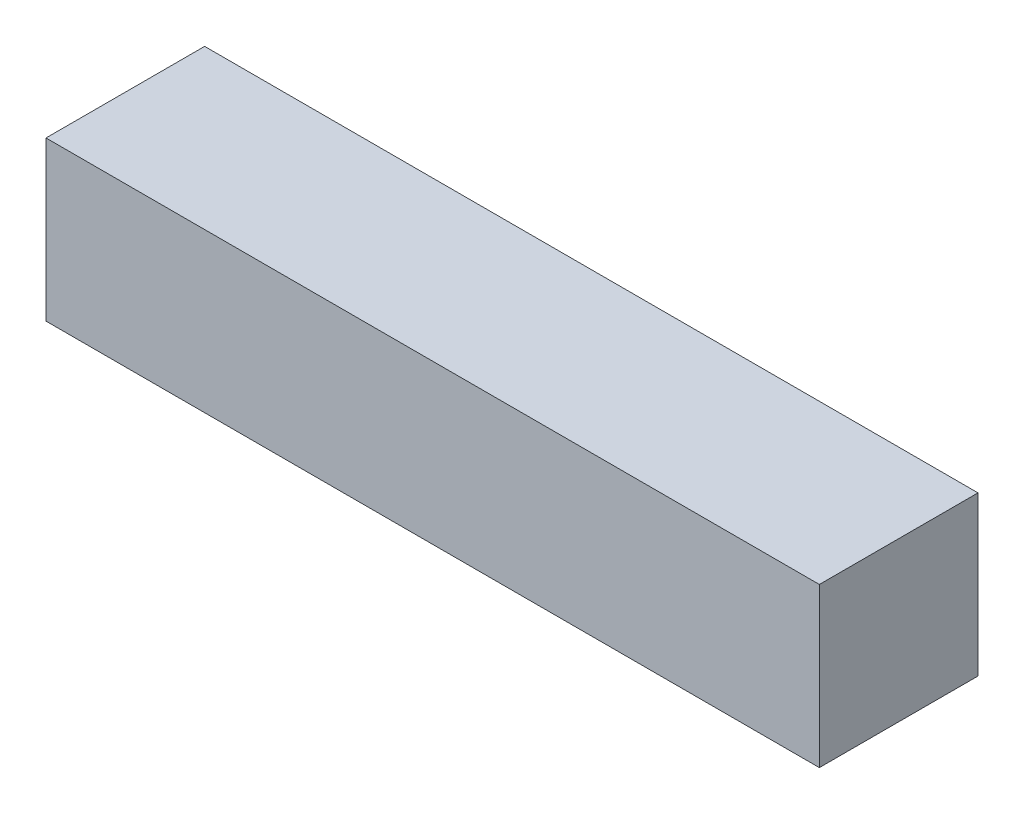
ISO-10303-21;
HEADER;
FILE_DESCRIPTION(('STEP AP214'),'2;1');
FILE_NAME('part.step','',(''),(''),'','','');
FILE_SCHEMA(('AUTOMOTIVE_DESIGN { 1 0 10303 214 1 1 1 1 }'));
ENDSEC;
DATA;
#1=APPLICATION_CONTEXT('core data for automotive mechanical design processes');
#2=APPLICATION_PROTOCOL_DEFINITION('international standard','automotive_design',2000,#1);
#3=PRODUCT_CONTEXT('',#1,'mechanical');
#4=PRODUCT('Part','Part','',(#3));
#5=PRODUCT_RELATED_PRODUCT_CATEGORY('part','',(#4));
#6=PRODUCT_DEFINITION_FORMATION('','',#4);
#7=PRODUCT_DEFINITION_CONTEXT('part definition',#1,'design');
#8=PRODUCT_DEFINITION('design','',#6,#7);
#9=PRODUCT_DEFINITION_SHAPE('','',#8);
#10=(LENGTH_UNIT() NAMED_UNIT(*) SI_UNIT(.MILLI.,.METRE.));
#11=(NAMED_UNIT(*) PLANE_ANGLE_UNIT() SI_UNIT($,.RADIAN.));
#12=(NAMED_UNIT(*) SI_UNIT($,.STERADIAN.) SOLID_ANGLE_UNIT());
#13=UNCERTAINTY_MEASURE_WITH_UNIT(LENGTH_MEASURE(1.E-05),#10,'distance_accuracy_value','');
#14=(GEOMETRIC_REPRESENTATION_CONTEXT(3) GLOBAL_UNCERTAINTY_ASSIGNED_CONTEXT((#13)) GLOBAL_UNIT_ASSIGNED_CONTEXT((#10,
#11,#12)) REPRESENTATION_CONTEXT('',''));
#15=CARTESIAN_POINT('',(0.,0.,0.));
#16=DIRECTION('',(0.,0.,1.));
#17=DIRECTION('',(1.,0.,0.));
#18=AXIS2_PLACEMENT_3D('',#15,#16,#17);
#19=CARTESIAN_POINT('',(-585.,0.,120.));
#20=DIRECTION('',(1.,0.,0.));
#21=DIRECTION('',(0.,0.,-1.));
#22=AXIS2_PLACEMENT_3D('',#19,#20,#21);
#23=PLANE('',#22);
#24=DIRECTION('',(0.,-1.,0.));
#25=VECTOR('',#24,1.);
#26=CARTESIAN_POINT('',(-585.,0.,-120.));
#27=LINE('',#26,#25);
#28=CARTESIAN_POINT('',(-585.,240.,-120.));
#29=VERTEX_POINT('',#28);
#30=CARTESIAN_POINT('',(-585.,0.,-120.));
#31=VERTEX_POINT('',#30);
#32=EDGE_CURVE('E99',#29,#31,#27,.T.);
#33=ORIENTED_EDGE('',*,*,#32,.T.);
#34=DIRECTION('',(0.,0.,-1.));
#35=VECTOR('',#34,1.);
#36=CARTESIAN_POINT('',(-585.,0.,120.));
#37=LINE('',#36,#35);
#38=CARTESIAN_POINT('',(-585.,0.,120.));
#39=VERTEX_POINT('',#38);
#40=EDGE_CURVE('E11',#39,#31,#37,.T.);
#41=ORIENTED_EDGE('',*,*,#40,.F.);
#42=DIRECTION('',(0.,-1.,0.));
#43=VECTOR('',#42,1.);
#44=CARTESIAN_POINT('',(-585.,0.,120.));
#45=LINE('',#44,#43);
#46=CARTESIAN_POINT('',(-585.,240.,120.));
#47=VERTEX_POINT('',#46);
#48=EDGE_CURVE('E87',#47,#39,#45,.T.);
#49=ORIENTED_EDGE('',*,*,#48,.F.);
#50=DIRECTION('',(0.,0.,-1.));
#51=VECTOR('',#50,1.);
#52=CARTESIAN_POINT('',(-585.,240.,120.));
#53=LINE('',#52,#51);
#54=EDGE_CURVE('E95',#47,#29,#53,.T.);
#55=ORIENTED_EDGE('',*,*,#54,.T.);
#56=EDGE_LOOP('',(#33,#41,#49,#55));
#57=FACE_BOUND('',#56,.T.);
#58=ADVANCED_FACE('F36',(#57),#23,.F.);
#59=CARTESIAN_POINT('',(-585.,0.,120.));
#60=DIRECTION('',(0.,1.,0.));
#61=DIRECTION('',(0.,0.,1.));
#62=AXIS2_PLACEMENT_3D('',#59,#60,#61);
#63=PLANE('',#62);
#64=DIRECTION('',(1.,0.,0.));
#65=VECTOR('',#64,1.);
#66=CARTESIAN_POINT('',(-585.,0.,-120.));
#67=LINE('',#66,#65);
#68=CARTESIAN_POINT('',(585.,0.,-120.));
#69=VERTEX_POINT('',#68);
#70=EDGE_CURVE('E91',#31,#69,#67,.T.);
#71=ORIENTED_EDGE('',*,*,#70,.T.);
#72=DIRECTION('',(0.,0.,-1.));
#73=VECTOR('',#72,1.);
#74=CARTESIAN_POINT('',(585.,0.,120.));
#75=LINE('',#74,#73);
#76=CARTESIAN_POINT('',(585.,0.,120.));
#77=VERTEX_POINT('',#76);
#78=EDGE_CURVE('E44',#77,#69,#75,.T.);
#79=ORIENTED_EDGE('',*,*,#78,.F.);
#80=DIRECTION('',(1.,0.,0.));
#81=VECTOR('',#80,1.);
#82=CARTESIAN_POINT('',(-585.,0.,120.));
#83=LINE('',#82,#81);
#84=EDGE_CURVE('E82',#39,#77,#83,.T.);
#85=ORIENTED_EDGE('',*,*,#84,.F.);
#86=ORIENTED_EDGE('',*,*,#40,.T.);
#87=EDGE_LOOP('',(#71,#79,#85,#86));
#88=FACE_BOUND('',#87,.T.);
#89=ADVANCED_FACE('F90',(#88),#63,.F.);
#90=CARTESIAN_POINT('',(585.,0.,120.));
#91=DIRECTION('',(-1.,0.,0.));
#92=DIRECTION('',(0.,0.,1.));
#93=AXIS2_PLACEMENT_3D('',#90,#91,#92);
#94=PLANE('',#93);
#95=DIRECTION('',(0.,1.,0.));
#96=VECTOR('',#95,1.);
#97=CARTESIAN_POINT('',(585.,0.,-120.));
#98=LINE('',#97,#96);
#99=CARTESIAN_POINT('',(585.,240.,-120.));
#100=VERTEX_POINT('',#99);
#101=EDGE_CURVE('E69',#69,#100,#98,.T.);
#102=ORIENTED_EDGE('',*,*,#101,.T.);
#103=DIRECTION('',(0.,0.,-1.));
#104=VECTOR('',#103,1.);
#105=CARTESIAN_POINT('',(585.,240.,120.));
#106=LINE('',#105,#104);
#107=CARTESIAN_POINT('',(585.,240.,120.));
#108=VERTEX_POINT('',#107);
#109=EDGE_CURVE('E92',#108,#100,#106,.T.);
#110=ORIENTED_EDGE('',*,*,#109,.F.);
#111=DIRECTION('',(0.,1.,0.));
#112=VECTOR('',#111,1.);
#113=CARTESIAN_POINT('',(585.,0.,120.));
#114=LINE('',#113,#112);
#115=EDGE_CURVE('E85',#77,#108,#114,.T.);
#116=ORIENTED_EDGE('',*,*,#115,.F.);
#117=ORIENTED_EDGE('',*,*,#78,.T.);
#118=EDGE_LOOP('',(#102,#110,#116,#117));
#119=FACE_BOUND('',#118,.T.);
#120=ADVANCED_FACE('F93',(#119),#94,.F.);
#121=CARTESIAN_POINT('',(-585.,240.,120.));
#122=DIRECTION('',(0.,-1.,0.));
#123=DIRECTION('',(0.,0.,-1.));
#124=AXIS2_PLACEMENT_3D('',#121,#122,#123);
#125=PLANE('',#124);
#126=DIRECTION('',(-1.,0.,0.));
#127=VECTOR('',#126,1.);
#128=CARTESIAN_POINT('',(-585.,240.,-120.));
#129=LINE('',#128,#127);
#130=EDGE_CURVE('E75',#100,#29,#129,.T.);
#131=ORIENTED_EDGE('',*,*,#130,.T.);
#132=ORIENTED_EDGE('',*,*,#54,.F.);
#133=DIRECTION('',(-1.,0.,0.));
#134=VECTOR('',#133,1.);
#135=CARTESIAN_POINT('',(-585.,240.,120.));
#136=LINE('',#135,#134);
#137=EDGE_CURVE('E52',#108,#47,#136,.T.);
#138=ORIENTED_EDGE('',*,*,#137,.F.);
#139=ORIENTED_EDGE('',*,*,#109,.T.);
#140=EDGE_LOOP('',(#131,#132,#138,#139));
#141=FACE_BOUND('',#140,.T.);
#142=ADVANCED_FACE('F106',(#141),#125,.F.);
#143=CARTESIAN_POINT('',(0.,0.,120.));
#144=DIRECTION('',(0.,0.,-1.));
#145=DIRECTION('',(-1.,0.,0.));
#146=AXIS2_PLACEMENT_3D('',#143,#144,#145);
#147=PLANE('',#146);
#148=ORIENTED_EDGE('',*,*,#48,.T.);
#149=ORIENTED_EDGE('',*,*,#84,.T.);
#150=ORIENTED_EDGE('',*,*,#115,.T.);
#151=ORIENTED_EDGE('',*,*,#137,.T.);
#152=EDGE_LOOP('',(#148,#149,#150,#151));
#153=FACE_BOUND('',#152,.T.);
#154=ADVANCED_FACE('F83',(#153),#147,.F.);
#155=CARTESIAN_POINT('',(0.,0.,-120.));
#156=DIRECTION('',(0.,0.,-1.));
#157=DIRECTION('',(-1.,0.,0.));
#158=AXIS2_PLACEMENT_3D('',#155,#156,#157);
#159=PLANE('',#158);
#160=ORIENTED_EDGE('',*,*,#32,.F.);
#161=ORIENTED_EDGE('',*,*,#130,.F.);
#162=ORIENTED_EDGE('',*,*,#101,.F.);
#163=ORIENTED_EDGE('',*,*,#70,.F.);
#164=EDGE_LOOP('',(#160,#161,#162,#163));
#165=FACE_BOUND('',#164,.T.);
#166=ADVANCED_FACE('F109',(#165),#159,.T.);
#167=CLOSED_SHELL('',(#58,#89,#120,#142,#154,#166));
#168=MANIFOLD_SOLID_BREP('B2',#167);
#169=ADVANCED_BREP_SHAPE_REPRESENTATION('',(#18,#168),#14);
#170=SHAPE_DEFINITION_REPRESENTATION(#9,#169);
ENDSEC;
END-ISO-10303-21;
